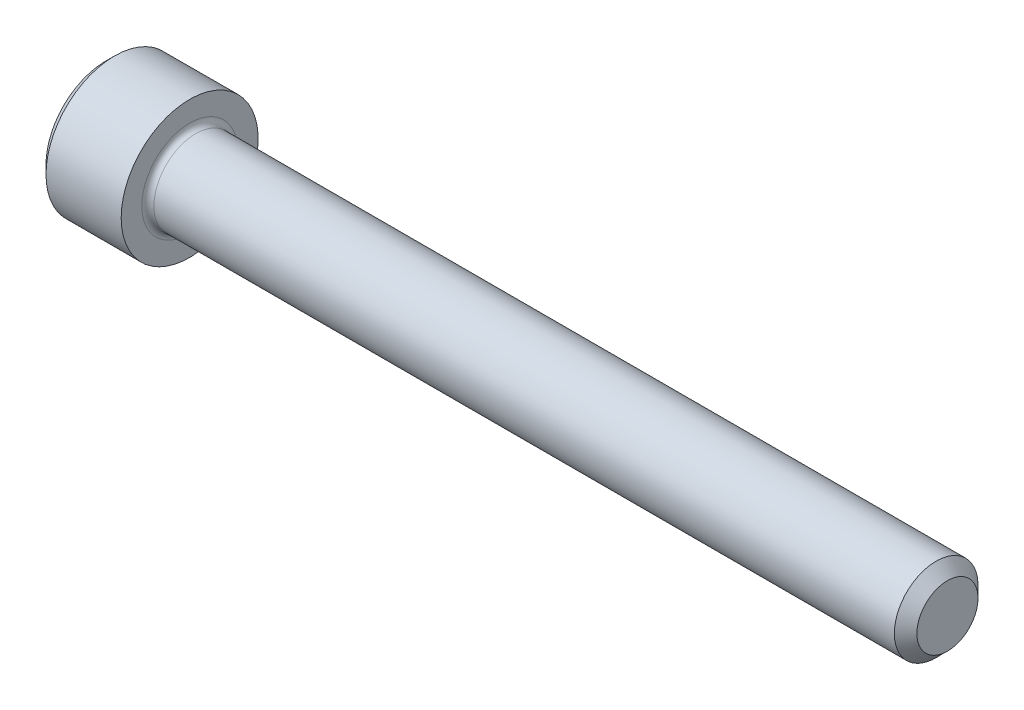
ISO-10303-21;
HEADER;
FILE_DESCRIPTION(('STEP AP214'),'2;1');
FILE_NAME('part.step','',(''),(''),'','','');
FILE_SCHEMA(('AUTOMOTIVE_DESIGN { 1 0 10303 214 1 1 1 1 }'));
ENDSEC;
DATA;
#1=APPLICATION_CONTEXT('core data for automotive mechanical design processes');
#2=APPLICATION_PROTOCOL_DEFINITION('international standard','automotive_design',2000,#1);
#3=PRODUCT_CONTEXT('',#1,'mechanical');
#4=PRODUCT('Part','Part','',(#3));
#5=PRODUCT_RELATED_PRODUCT_CATEGORY('part','',(#4));
#6=PRODUCT_DEFINITION_FORMATION('','',#4);
#7=PRODUCT_DEFINITION_CONTEXT('part definition',#1,'design');
#8=PRODUCT_DEFINITION('design','',#6,#7);
#9=PRODUCT_DEFINITION_SHAPE('','',#8);
#10=(LENGTH_UNIT() NAMED_UNIT(*) SI_UNIT(.MILLI.,.METRE.));
#11=(NAMED_UNIT(*) PLANE_ANGLE_UNIT() SI_UNIT($,.RADIAN.));
#12=(NAMED_UNIT(*) SI_UNIT($,.STERADIAN.) SOLID_ANGLE_UNIT());
#13=UNCERTAINTY_MEASURE_WITH_UNIT(LENGTH_MEASURE(1.E-05),#10,'distance_accuracy_value','');
#14=(GEOMETRIC_REPRESENTATION_CONTEXT(3) GLOBAL_UNCERTAINTY_ASSIGNED_CONTEXT((#13)) GLOBAL_UNIT_ASSIGNED_CONTEXT((#10,
#11,#12)) REPRESENTATION_CONTEXT('',''));
#15=CARTESIAN_POINT('',(0.,0.,0.));
#16=DIRECTION('',(0.,0.,1.));
#17=DIRECTION('',(1.,0.,0.));
#18=AXIS2_PLACEMENT_3D('',#15,#16,#17);
#19=CARTESIAN_POINT('',(1.62560000006806,0.,0.));
#20=DIRECTION('',(-1.,0.,0.));
#21=DIRECTION('',(0.,0.,1.));
#22=AXIS2_PLACEMENT_3D('',#19,#20,#21);
#23=CONICAL_SURFACE('',#22,1.38430000004064,1.04719755119643);
#24=CARTESIAN_POINT('',(2.42482597772664,0.,5.6843418860808E-11));
#25=VERTEX_POINT('',#24);
#26=VERTEX_LOOP('',#25);
#27=FACE_BOUND('',#26,.T.);
#28=CARTESIAN_POINT('',(1.62560000006806,0.,0.));
#29=DIRECTION('',(-1.,0.,0.));
#30=DIRECTION('',(0.,0.,1.));
#31=AXIS2_PLACEMENT_3D('',#28,#29,#30);
#32=CIRCLE('',#31,1.38430000004064);
#33=CARTESIAN_POINT('',(1.62560000003403,0.,1.38430000002032));
#34=VERTEX_POINT('',#33);
#35=CARTESIAN_POINT('',(1.62560000003403,-1.19883896647639,0.69215000001016));
#36=VERTEX_POINT('',#35);
#37=EDGE_CURVE('E98',#34,#36,#32,.F.);
#38=ORIENTED_EDGE('',*,*,#37,.F.);
#39=CARTESIAN_POINT('',(1.62560000006806,0.,0.));
#40=DIRECTION('',(-1.,0.,0.));
#41=DIRECTION('',(0.,0.,1.));
#42=AXIS2_PLACEMENT_3D('',#39,#40,#41);
#43=CIRCLE('',#42,1.38430000004064);
#44=CARTESIAN_POINT('',(1.62560000003403,1.1988389664764,0.692150000010158));
#45=VERTEX_POINT('',#44);
#46=EDGE_CURVE('E95',#45,#34,#43,.F.);
#47=ORIENTED_EDGE('',*,*,#46,.F.);
#48=CARTESIAN_POINT('',(1.62560000006806,0.,0.));
#49=DIRECTION('',(-1.,0.,0.));
#50=DIRECTION('',(0.,0.,1.));
#51=AXIS2_PLACEMENT_3D('',#48,#49,#50);
#52=CIRCLE('',#51,1.38430000004064);
#53=CARTESIAN_POINT('',(1.62560000003403,1.1988389664764,-0.692150000010162));
#54=VERTEX_POINT('',#53);
#55=EDGE_CURVE('E156',#54,#45,#52,.F.);
#56=ORIENTED_EDGE('',*,*,#55,.F.);
#57=CARTESIAN_POINT('',(1.62560000006806,0.,0.));
#58=DIRECTION('',(-1.,0.,0.));
#59=DIRECTION('',(0.,0.,1.));
#60=AXIS2_PLACEMENT_3D('',#57,#58,#59);
#61=CIRCLE('',#60,1.38430000004064);
#62=CARTESIAN_POINT('',(1.62560000003403,0.,-1.38430000002032));
#63=VERTEX_POINT('',#62);
#64=EDGE_CURVE('E153',#63,#54,#61,.F.);
#65=ORIENTED_EDGE('',*,*,#64,.F.);
#66=CARTESIAN_POINT('',(1.62560000006806,0.,0.));
#67=DIRECTION('',(-1.,0.,0.));
#68=DIRECTION('',(0.,0.,1.));
#69=AXIS2_PLACEMENT_3D('',#66,#67,#68);
#70=CIRCLE('',#69,1.38430000004064);
#71=CARTESIAN_POINT('',(1.62560000003403,-1.19883896647639,-0.692150000010157));
#72=VERTEX_POINT('',#71);
#73=EDGE_CURVE('E158',#72,#63,#70,.F.);
#74=ORIENTED_EDGE('',*,*,#73,.F.);
#75=CARTESIAN_POINT('',(1.62560000006806,0.,0.));
#76=DIRECTION('',(-1.,0.,0.));
#77=DIRECTION('',(0.,0.,1.));
#78=AXIS2_PLACEMENT_3D('',#75,#76,#77);
#79=CIRCLE('',#78,1.38430000004064);
#80=EDGE_CURVE('E101',#36,#72,#79,.F.);
#81=ORIENTED_EDGE('',*,*,#80,.F.);
#82=EDGE_LOOP('',(#38,#47,#56,#65,#74,#81));
#83=FACE_BOUND('',#82,.T.);
#84=ADVANCED_FACE('F16',(#27,#83),#23,.F.);
#85=CARTESIAN_POINT('',(1.6256,0.799225977639204,1.3843));
#86=DIRECTION('',(-1.,0.,0.));
#87=DIRECTION('',(0.,0.,1.));
#88=AXIS2_PLACEMENT_3D('',#85,#86,#87);
#89=PLANE('',#88);
#90=DIRECTION('',(0.,-1.,0.));
#91=VECTOR('',#90,1.);
#92=CARTESIAN_POINT('',(1.6256,-0.799225977639192,1.3843));
#93=LINE('',#92,#91);
#94=CARTESIAN_POINT('',(1.6256,0.799225977639205,1.3843));
#95=VERTEX_POINT('',#94);
#96=EDGE_CURVE('E113',#34,#95,#93,.F.);
#97=ORIENTED_EDGE('',*,*,#96,.T.);
#98=DIRECTION('',(0.,0.499999999999999,-0.86602540378444));
#99=VECTOR('',#98,1.);
#100=CARTESIAN_POINT('',(1.6256,1.5984519552784,0.));
#101=LINE('',#100,#99);
#102=EDGE_CURVE('E114',#45,#95,#101,.F.);
#103=ORIENTED_EDGE('',*,*,#102,.F.);
#104=ORIENTED_EDGE('',*,*,#46,.T.);
#105=EDGE_LOOP('',(#97,#103,#104));
#106=FACE_BOUND('',#105,.T.);
#107=ADVANCED_FACE('F118',(#106),#89,.T.);
#108=CARTESIAN_POINT('',(1.6256,0.799225977639204,1.3843));
#109=DIRECTION('',(-1.,0.,0.));
#110=DIRECTION('',(0.,0.,1.));
#111=AXIS2_PLACEMENT_3D('',#108,#109,#110);
#112=PLANE('',#111);
#113=DIRECTION('',(0.,0.500000000000001,0.866025403784438));
#114=VECTOR('',#113,1.);
#115=CARTESIAN_POINT('',(1.6256,-0.799225977639192,1.3843));
#116=LINE('',#115,#114);
#117=CARTESIAN_POINT('',(1.6256,-0.799225977639192,1.3843));
#118=VERTEX_POINT('',#117);
#119=EDGE_CURVE('E109',#118,#36,#116,.F.);
#120=ORIENTED_EDGE('',*,*,#119,.F.);
#121=DIRECTION('',(0.,-1.,0.));
#122=VECTOR('',#121,1.);
#123=CARTESIAN_POINT('',(1.6256,-0.799225977639192,1.3843));
#124=LINE('',#123,#122);
#125=EDGE_CURVE('E106',#118,#34,#124,.F.);
#126=ORIENTED_EDGE('',*,*,#125,.T.);
#127=ORIENTED_EDGE('',*,*,#37,.T.);
#128=EDGE_LOOP('',(#120,#126,#127));
#129=FACE_BOUND('',#128,.T.);
#130=ADVANCED_FACE('F107',(#129),#112,.T.);
#131=CARTESIAN_POINT('',(1.6256,0.799225977639204,1.3843));
#132=DIRECTION('',(-1.,0.,0.));
#133=DIRECTION('',(0.,0.,1.));
#134=AXIS2_PLACEMENT_3D('',#131,#132,#133);
#135=PLANE('',#134);
#136=DIRECTION('',(0.,-0.499999999999999,0.866025403784439));
#137=VECTOR('',#136,1.);
#138=CARTESIAN_POINT('',(1.6256,-1.59845195527839,0.));
#139=LINE('',#138,#137);
#140=CARTESIAN_POINT('',(1.6256,-1.59845195527839,0.));
#141=VERTEX_POINT('',#140);
#142=EDGE_CURVE('E420',#141,#72,#139,.F.);
#143=ORIENTED_EDGE('',*,*,#142,.F.);
#144=DIRECTION('',(0.,0.500000000000001,0.866025403784438));
#145=VECTOR('',#144,1.);
#146=CARTESIAN_POINT('',(1.6256,-0.799225977639192,1.3843));
#147=LINE('',#146,#145);
#148=EDGE_CURVE('E422',#36,#141,#147,.F.);
#149=ORIENTED_EDGE('',*,*,#148,.F.);
#150=ORIENTED_EDGE('',*,*,#80,.T.);
#151=EDGE_LOOP('',(#143,#149,#150));
#152=FACE_BOUND('',#151,.T.);
#153=ADVANCED_FACE('F277',(#152),#135,.T.);
#154=CARTESIAN_POINT('',(1.6256,0.799225977639204,1.3843));
#155=DIRECTION('',(-1.,0.,0.));
#156=DIRECTION('',(0.,0.,1.));
#157=AXIS2_PLACEMENT_3D('',#154,#155,#156);
#158=PLANE('',#157);
#159=DIRECTION('',(0.,1.,0.));
#160=VECTOR('',#159,1.);
#161=CARTESIAN_POINT('',(1.6256,0.799225977639201,-1.3843));
#162=LINE('',#161,#160);
#163=CARTESIAN_POINT('',(1.6256,-0.799225977639196,-1.3843));
#164=VERTEX_POINT('',#163);
#165=EDGE_CURVE('E476',#63,#164,#162,.F.);
#166=ORIENTED_EDGE('',*,*,#165,.T.);
#167=DIRECTION('',(0.,-0.499999999999999,0.866025403784439));
#168=VECTOR('',#167,1.);
#169=CARTESIAN_POINT('',(1.6256,-1.59845195527839,0.));
#170=LINE('',#169,#168);
#171=EDGE_CURVE('E425',#72,#164,#170,.F.);
#172=ORIENTED_EDGE('',*,*,#171,.F.);
#173=ORIENTED_EDGE('',*,*,#73,.T.);
#174=EDGE_LOOP('',(#166,#172,#173));
#175=FACE_BOUND('',#174,.T.);
#176=ADVANCED_FACE('F273',(#175),#158,.T.);
#177=CARTESIAN_POINT('',(1.6256,0.799225977639204,1.3843));
#178=DIRECTION('',(-1.,0.,0.));
#179=DIRECTION('',(0.,0.,1.));
#180=AXIS2_PLACEMENT_3D('',#177,#178,#179);
#181=PLANE('',#180);
#182=DIRECTION('',(0.,0.499999999999999,-0.86602540378444));
#183=VECTOR('',#182,1.);
#184=CARTESIAN_POINT('',(1.6256,1.5984519552784,0.));
#185=LINE('',#184,#183);
#186=CARTESIAN_POINT('',(1.6256,1.5984519552784,0.));
#187=VERTEX_POINT('',#186);
#188=EDGE_CURVE('E136',#187,#45,#185,.F.);
#189=ORIENTED_EDGE('',*,*,#188,.F.);
#190=DIRECTION('',(0.,0.500000000000001,0.866025403784438));
#191=VECTOR('',#190,1.);
#192=CARTESIAN_POINT('',(1.6256,1.5984519552784,0.));
#193=LINE('',#192,#191);
#194=EDGE_CURVE('E491',#187,#54,#193,.F.);
#195=ORIENTED_EDGE('',*,*,#194,.T.);
#196=ORIENTED_EDGE('',*,*,#55,.T.);
#197=EDGE_LOOP('',(#189,#195,#196));
#198=FACE_BOUND('',#197,.T.);
#199=ADVANCED_FACE('F269',(#198),#181,.T.);
#200=CARTESIAN_POINT('',(1.6256,0.799225977639204,1.3843));
#201=DIRECTION('',(-1.,0.,0.));
#202=DIRECTION('',(0.,0.,1.));
#203=AXIS2_PLACEMENT_3D('',#200,#201,#202);
#204=PLANE('',#203);
#205=DIRECTION('',(0.,0.500000000000001,0.866025403784438));
#206=VECTOR('',#205,1.);
#207=CARTESIAN_POINT('',(1.6256,1.5984519552784,0.));
#208=LINE('',#207,#206);
#209=CARTESIAN_POINT('',(1.6256,0.799225977639201,-1.3843));
#210=VERTEX_POINT('',#209);
#211=EDGE_CURVE('E465',#54,#210,#208,.F.);
#212=ORIENTED_EDGE('',*,*,#211,.T.);
#213=DIRECTION('',(0.,1.,0.));
#214=VECTOR('',#213,1.);
#215=CARTESIAN_POINT('',(1.6256,0.799225977639201,-1.3843));
#216=LINE('',#215,#214);
#217=EDGE_CURVE('E479',#210,#63,#216,.F.);
#218=ORIENTED_EDGE('',*,*,#217,.T.);
#219=ORIENTED_EDGE('',*,*,#64,.T.);
#220=EDGE_LOOP('',(#212,#218,#219));
#221=FACE_BOUND('',#220,.T.);
#222=ADVANCED_FACE('F265',(#221),#204,.T.);
#223=CARTESIAN_POINT('',(1.6256,1.5984519552784,0.));
#224=DIRECTION('',(0.,-0.86602540378444,-0.499999999999999));
#225=DIRECTION('',(0.,0.499999999999999,-0.86602540378444));
#226=AXIS2_PLACEMENT_3D('',#223,#224,#225);
#227=PLANE('',#226);
#228=ORIENTED_EDGE('',*,*,#102,.T.);
#229=DIRECTION('',(1.,0.,0.));
#230=VECTOR('',#229,1.);
#231=CARTESIAN_POINT('',(1.6256,0.799225977639205,1.3843));
#232=LINE('',#231,#230);
#233=CARTESIAN_POINT('',(0.,0.799225977639205,1.3843));
#234=VERTEX_POINT('',#233);
#235=EDGE_CURVE('E125',#95,#234,#232,.F.);
#236=ORIENTED_EDGE('',*,*,#235,.T.);
#237=DIRECTION('',(0.,-0.499999999999999,0.866025403784439));
#238=VECTOR('',#237,1.);
#239=CARTESIAN_POINT('',(0.,1.5984519552784,0.));
#240=LINE('',#239,#238);
#241=CARTESIAN_POINT('',(0.,1.5984519552784,0.));
#242=VERTEX_POINT('',#241);
#243=EDGE_CURVE('E459',#242,#234,#240,.T.);
#244=ORIENTED_EDGE('',*,*,#243,.F.);
#245=DIRECTION('',(1.,0.,0.));
#246=VECTOR('',#245,1.);
#247=CARTESIAN_POINT('',(1.6256,1.5984519552784,0.));
#248=LINE('',#247,#246);
#249=EDGE_CURVE('E486',#242,#187,#248,.T.);
#250=ORIENTED_EDGE('',*,*,#249,.T.);
#251=ORIENTED_EDGE('',*,*,#188,.T.);
#252=EDGE_LOOP('',(#228,#236,#244,#250,#251));
#253=FACE_BOUND('',#252,.T.);
#254=ADVANCED_FACE('F262',(#253),#227,.T.);
#255=CARTESIAN_POINT('',(1.6256,-0.799225977639192,1.3843));
#256=DIRECTION('',(0.,0.,1.));
#257=DIRECTION('',(0.,-1.,0.));
#258=AXIS2_PLACEMENT_3D('',#255,#256,#257);
#259=PLANE('',#258);
#260=ORIENTED_EDGE('',*,*,#235,.F.);
#261=ORIENTED_EDGE('',*,*,#96,.F.);
#262=ORIENTED_EDGE('',*,*,#125,.F.);
#263=DIRECTION('',(1.,0.,0.));
#264=VECTOR('',#263,1.);
#265=CARTESIAN_POINT('',(1.6256,-0.799225977639192,1.3843));
#266=LINE('',#265,#264);
#267=CARTESIAN_POINT('',(0.,-0.799225977639192,1.3843));
#268=VERTEX_POINT('',#267);
#269=EDGE_CURVE('E127',#268,#118,#266,.T.);
#270=ORIENTED_EDGE('',*,*,#269,.F.);
#271=DIRECTION('',(0.,1.,0.));
#272=VECTOR('',#271,1.);
#273=CARTESIAN_POINT('',(0.,0.,1.3843));
#274=LINE('',#273,#272);
#275=EDGE_CURVE('E448',#234,#268,#274,.F.);
#276=ORIENTED_EDGE('',*,*,#275,.F.);
#277=EDGE_LOOP('',(#260,#261,#262,#270,#276));
#278=FACE_BOUND('',#277,.T.);
#279=ADVANCED_FACE('F123',(#278),#259,.F.);
#280=CARTESIAN_POINT('',(1.6256,-0.799225977639192,1.3843));
#281=DIRECTION('',(0.,0.866025403784438,-0.500000000000001));
#282=DIRECTION('',(0.,0.500000000000001,0.866025403784438));
#283=AXIS2_PLACEMENT_3D('',#280,#281,#282);
#284=PLANE('',#283);
#285=ORIENTED_EDGE('',*,*,#148,.T.);
#286=DIRECTION('',(1.,0.,0.));
#287=VECTOR('',#286,1.);
#288=CARTESIAN_POINT('',(1.6256,-1.59845195527839,0.));
#289=LINE('',#288,#287);
#290=CARTESIAN_POINT('',(0.,-1.59845195527839,0.));
#291=VERTEX_POINT('',#290);
#292=EDGE_CURVE('E426',#291,#141,#289,.T.);
#293=ORIENTED_EDGE('',*,*,#292,.F.);
#294=DIRECTION('',(0.,-0.500000000000001,-0.866025403784438));
#295=VECTOR('',#294,1.);
#296=CARTESIAN_POINT('',(0.,-0.799225977639192,1.3843));
#297=LINE('',#296,#295);
#298=EDGE_CURVE('E444',#268,#291,#297,.T.);
#299=ORIENTED_EDGE('',*,*,#298,.F.);
#300=ORIENTED_EDGE('',*,*,#269,.T.);
#301=ORIENTED_EDGE('',*,*,#119,.T.);
#302=EDGE_LOOP('',(#285,#293,#299,#300,#301));
#303=FACE_BOUND('',#302,.T.);
#304=ADVANCED_FACE('F255',(#303),#284,.T.);
#305=CARTESIAN_POINT('',(1.6256,-1.59845195527839,0.));
#306=DIRECTION('',(0.,0.866025403784439,0.499999999999999));
#307=DIRECTION('',(0.,-0.499999999999999,0.866025403784439));
#308=AXIS2_PLACEMENT_3D('',#305,#306,#307);
#309=PLANE('',#308);
#310=ORIENTED_EDGE('',*,*,#171,.T.);
#311=DIRECTION('',(1.,0.,0.));
#312=VECTOR('',#311,1.);
#313=CARTESIAN_POINT('',(1.6256,-0.799225977639196,-1.3843));
#314=LINE('',#313,#312);
#315=CARTESIAN_POINT('',(0.,-0.799225977639196,-1.3843));
#316=VERTEX_POINT('',#315);
#317=EDGE_CURVE('E478',#164,#316,#314,.F.);
#318=ORIENTED_EDGE('',*,*,#317,.T.);
#319=DIRECTION('',(0.,0.499999999999999,-0.866025403784439));
#320=VECTOR('',#319,1.);
#321=CARTESIAN_POINT('',(0.,-1.59845195527839,0.));
#322=LINE('',#321,#320);
#323=EDGE_CURVE('E430',#291,#316,#322,.T.);
#324=ORIENTED_EDGE('',*,*,#323,.F.);
#325=ORIENTED_EDGE('',*,*,#292,.T.);
#326=ORIENTED_EDGE('',*,*,#142,.T.);
#327=EDGE_LOOP('',(#310,#318,#324,#325,#326));
#328=FACE_BOUND('',#327,.T.);
#329=ADVANCED_FACE('F251',(#328),#309,.T.);
#330=CARTESIAN_POINT('',(1.6256,0.799225977639201,-1.3843));
#331=DIRECTION('',(0.,0.,-1.));
#332=DIRECTION('',(0.,1.,0.));
#333=AXIS2_PLACEMENT_3D('',#330,#331,#332);
#334=PLANE('',#333);
#335=ORIENTED_EDGE('',*,*,#317,.F.);
#336=ORIENTED_EDGE('',*,*,#165,.F.);
#337=ORIENTED_EDGE('',*,*,#217,.F.);
#338=DIRECTION('',(1.,0.,0.));
#339=VECTOR('',#338,1.);
#340=CARTESIAN_POINT('',(1.6256,0.799225977639201,-1.3843));
#341=LINE('',#340,#339);
#342=CARTESIAN_POINT('',(0.,0.799225977639201,-1.3843));
#343=VERTEX_POINT('',#342);
#344=EDGE_CURVE('E462',#210,#343,#341,.F.);
#345=ORIENTED_EDGE('',*,*,#344,.T.);
#346=DIRECTION('',(0.,1.,0.));
#347=VECTOR('',#346,1.);
#348=CARTESIAN_POINT('',(0.,0.,-1.3843));
#349=LINE('',#348,#347);
#350=EDGE_CURVE('E443',#316,#343,#349,.T.);
#351=ORIENTED_EDGE('',*,*,#350,.F.);
#352=EDGE_LOOP('',(#335,#336,#337,#345,#351));
#353=FACE_BOUND('',#352,.T.);
#354=ADVANCED_FACE('F247',(#353),#334,.F.);
#355=CARTESIAN_POINT('',(1.6256,1.5984519552784,0.));
#356=DIRECTION('',(0.,0.866025403784438,-0.500000000000001));
#357=DIRECTION('',(0.,0.500000000000001,0.866025403784438));
#358=AXIS2_PLACEMENT_3D('',#355,#356,#357);
#359=PLANE('',#358);
#360=ORIENTED_EDGE('',*,*,#344,.F.);
#361=ORIENTED_EDGE('',*,*,#211,.F.);
#362=ORIENTED_EDGE('',*,*,#194,.F.);
#363=ORIENTED_EDGE('',*,*,#249,.F.);
#364=DIRECTION('',(0.,0.500000000000001,0.866025403784438));
#365=VECTOR('',#364,1.);
#366=CARTESIAN_POINT('',(0.,0.799225977639201,-1.3843));
#367=LINE('',#366,#365);
#368=EDGE_CURVE('E152',#343,#242,#367,.T.);
#369=ORIENTED_EDGE('',*,*,#368,.F.);
#370=EDGE_LOOP('',(#360,#361,#362,#363,#369));
#371=FACE_BOUND('',#370,.T.);
#372=ADVANCED_FACE('F243',(#371),#359,.F.);
#373=CARTESIAN_POINT('',(0.,0.,0.));
#374=DIRECTION('',(-1.,0.,0.));
#375=DIRECTION('',(0.,0.,1.));
#376=AXIS2_PLACEMENT_3D('',#373,#374,#375);
#377=PLANE('',#376);
#378=CARTESIAN_POINT('',(0.,0.,0.));
#379=DIRECTION('',(1.,0.,0.));
#380=DIRECTION('',(0.,0.,-1.));
#381=AXIS2_PLACEMENT_3D('',#378,#379,#380);
#382=CIRCLE('',#381,2.5145999999836);
#383=CARTESIAN_POINT('',(0.,0.,-2.5145999999836));
#384=VERTEX_POINT('',#383);
#385=EDGE_CURVE('E149',#384,#384,#382,.T.);
#386=ORIENTED_EDGE('',*,*,#385,.F.);
#387=EDGE_LOOP('',(#386));
#388=FACE_BOUND('',#387,.T.);
#389=ORIENTED_EDGE('',*,*,#350,.T.);
#390=ORIENTED_EDGE('',*,*,#368,.T.);
#391=ORIENTED_EDGE('',*,*,#243,.T.);
#392=ORIENTED_EDGE('',*,*,#275,.T.);
#393=ORIENTED_EDGE('',*,*,#298,.T.);
#394=ORIENTED_EDGE('',*,*,#323,.T.);
#395=EDGE_LOOP('',(#389,#390,#391,#392,#393,#394));
#396=FACE_BOUND('',#395,.T.);
#397=ADVANCED_FACE('F235',(#388,#396),#377,.T.);
#398=CARTESIAN_POINT('',(0.355599999863898,0.,0.));
#399=DIRECTION('',(1.,0.,0.));
#400=DIRECTION('',(0.,0.,-1.));
#401=AXIS2_PLACEMENT_3D('',#398,#399,#400);
#402=CONICAL_SURFACE('',#401,2.87019999990434,0.785398163477374);
#403=ORIENTED_EDGE('',*,*,#385,.T.);
#404=EDGE_LOOP('',(#403));
#405=FACE_BOUND('',#404,.T.);
#406=CARTESIAN_POINT('',(0.355599999999998,0.,0.));
#407=DIRECTION('',(-1.,0.,0.));
#408=DIRECTION('',(0.,0.,1.));
#409=AXIS2_PLACEMENT_3D('',#406,#407,#408);
#410=CIRCLE('',#409,2.8702);
#411=CARTESIAN_POINT('',(0.355599999999998,0.,2.8702));
#412=VERTEX_POINT('',#411);
#413=EDGE_CURVE('E148',#412,#412,#410,.F.);
#414=ORIENTED_EDGE('',*,*,#413,.F.);
#415=EDGE_LOOP('',(#414));
#416=FACE_BOUND('',#415,.T.);
#417=ADVANCED_FACE('F230',(#405,#416),#402,.T.);
#418=CARTESIAN_POINT('',(-31.75,0.,0.));
#419=DIRECTION('',(-1.,0.,0.));
#420=DIRECTION('',(0.,0.,1.));
#421=AXIS2_PLACEMENT_3D('',#418,#419,#420);
#422=CYLINDRICAL_SURFACE('',#421,2.8702);
#423=CARTESIAN_POINT('',(3.5052,0.,0.));
#424=DIRECTION('',(-1.,0.,0.));
#425=DIRECTION('',(0.,0.,1.));
#426=AXIS2_PLACEMENT_3D('',#423,#424,#425);
#427=CIRCLE('',#426,2.8702);
#428=CARTESIAN_POINT('',(3.5052,0.,2.8702));
#429=VERTEX_POINT('',#428);
#430=EDGE_CURVE('E145',#429,#429,#427,.F.);
#431=ORIENTED_EDGE('',*,*,#430,.F.);
#432=EDGE_LOOP('',(#431));
#433=FACE_BOUND('',#432,.T.);
#434=ORIENTED_EDGE('',*,*,#413,.T.);
#435=EDGE_LOOP('',(#434));
#436=FACE_BOUND('',#435,.T.);
#437=ADVANCED_FACE('F226',(#433,#436),#422,.T.);
#438=CARTESIAN_POINT('',(35.2552,1.28016,0.));
#439=DIRECTION('',(1.,0.,0.));
#440=DIRECTION('',(0.,0.,-1.));
#441=AXIS2_PLACEMENT_3D('',#438,#439,#440);
#442=PLANE('',#441);
#443=CARTESIAN_POINT('',(35.2551999999946,0.,0.));
#444=DIRECTION('',(-1.,0.,0.));
#445=DIRECTION('',(0.,0.,1.));
#446=AXIS2_PLACEMENT_3D('',#443,#444,#445);
#447=CIRCLE('',#446,1.28016000007847);
#448=CARTESIAN_POINT('',(35.2551999999946,0.,1.28016000007847));
#449=VERTEX_POINT('',#448);
#450=EDGE_CURVE('E141',#449,#449,#447,.T.);
#451=ORIENTED_EDGE('',*,*,#450,.F.);
#452=EDGE_LOOP('',(#451));
#453=FACE_BOUND('',#452,.T.);
#454=ADVANCED_FACE('F184',(#453),#442,.T.);
#455=CARTESIAN_POINT('',(3.5052,2.8702,0.));
#456=DIRECTION('',(1.,0.,0.));
#457=DIRECTION('',(0.,0.,-1.));
#458=AXIS2_PLACEMENT_3D('',#455,#456,#457);
#459=PLANE('',#458);
#460=ORIENTED_EDGE('',*,*,#430,.T.);
#461=EDGE_LOOP('',(#460));
#462=FACE_BOUND('',#461,.T.);
#463=CARTESIAN_POINT('',(3.5052,0.,0.));
#464=DIRECTION('',(1.,0.,0.));
#465=DIRECTION('',(0.,0.,1.));
#466=AXIS2_PLACEMENT_3D('',#463,#464,#465);
#467=CIRCLE('',#466,2.0066);
#468=CARTESIAN_POINT('',(3.5052,0.,-2.0066));
#469=VERTEX_POINT('',#468);
#470=CARTESIAN_POINT('',(3.5052,0.,2.0066));
#471=VERTEX_POINT('',#470);
#472=EDGE_CURVE('E144',#469,#471,#467,.F.);
#473=ORIENTED_EDGE('',*,*,#472,.T.);
#474=CARTESIAN_POINT('',(3.5052,0.,0.));
#475=DIRECTION('',(1.,0.,0.));
#476=DIRECTION('',(0.,0.,-1.));
#477=AXIS2_PLACEMENT_3D('',#474,#475,#476);
#478=CIRCLE('',#477,2.0066);
#479=EDGE_CURVE('E35',#471,#469,#478,.F.);
#480=ORIENTED_EDGE('',*,*,#479,.T.);
#481=EDGE_LOOP('',(#473,#480));
#482=FACE_BOUND('',#481,.T.);
#483=ADVANCED_FACE('F165',(#462,#482),#459,.T.);
#484=CARTESIAN_POINT('',(34.7827599999846,0.,0.));
#485=DIRECTION('',(-1.,0.,0.));
#486=DIRECTION('',(0.,0.,1.));
#487=AXIS2_PLACEMENT_3D('',#484,#485,#486);
#488=CONICAL_SURFACE('',#487,1.75260000008848,0.785398163397448);
#489=CARTESIAN_POINT('',(34.78276,0.,0.));
#490=DIRECTION('',(-1.,0.,0.));
#491=DIRECTION('',(0.,0.,1.));
#492=AXIS2_PLACEMENT_3D('',#489,#490,#491);
#493=CIRCLE('',#492,1.7526);
#494=CARTESIAN_POINT('',(34.78276,0.,1.7526));
#495=VERTEX_POINT('',#494);
#496=EDGE_CURVE('E27',#495,#495,#493,.T.);
#497=ORIENTED_EDGE('',*,*,#496,.F.);
#498=EDGE_LOOP('',(#497));
#499=FACE_BOUND('',#498,.T.);
#500=ORIENTED_EDGE('',*,*,#450,.T.);
#501=EDGE_LOOP('',(#500));
#502=FACE_BOUND('',#501,.T.);
#503=ADVANCED_FACE('F183',(#499,#502),#488,.T.);
#504=CARTESIAN_POINT('',(3.7592,0.,0.));
#505=DIRECTION('',(1.,0.,0.));
#506=DIRECTION('',(0.,0.,-1.));
#507=AXIS2_PLACEMENT_3D('',#504,#505,#506);
#508=TOROIDAL_SURFACE('',#507,2.0066,0.254);
#509=CARTESIAN_POINT('',(3.7592,0.,0.));
#510=DIRECTION('',(-1.,0.,0.));
#511=DIRECTION('',(0.,0.,1.));
#512=AXIS2_PLACEMENT_3D('',#509,#510,#511);
#513=CIRCLE('',#512,1.7526);
#514=CARTESIAN_POINT('',(3.7592,0.,1.7526));
#515=VERTEX_POINT('',#514);
#516=EDGE_CURVE('E11',#515,#515,#513,.F.);
#517=ORIENTED_EDGE('',*,*,#516,.F.);
#518=EDGE_LOOP('',(#517));
#519=FACE_BOUND('',#518,.T.);
#520=ORIENTED_EDGE('',*,*,#472,.F.);
#521=ORIENTED_EDGE('',*,*,#479,.F.);
#522=EDGE_LOOP('',(#520,#521));
#523=FACE_BOUND('',#522,.T.);
#524=ADVANCED_FACE('F162',(#519,#523),#508,.F.);
#525=CARTESIAN_POINT('',(-31.75,0.,0.));
#526=DIRECTION('',(-1.,0.,0.));
#527=DIRECTION('',(0.,0.,1.));
#528=AXIS2_PLACEMENT_3D('',#525,#526,#527);
#529=CYLINDRICAL_SURFACE('',#528,1.7526);
#530=ORIENTED_EDGE('',*,*,#516,.T.);
#531=EDGE_LOOP('',(#530));
#532=FACE_BOUND('',#531,.T.);
#533=ORIENTED_EDGE('',*,*,#496,.T.);
#534=EDGE_LOOP('',(#533));
#535=FACE_BOUND('',#534,.T.);
#536=ADVANCED_FACE('F208',(#532,#535),#529,.T.);
#537=CLOSED_SHELL('',(#84,#107,#130,#153,#176,#199,#222,#254,#279,#304,#329,#354,#372,#397,#417,
#437,#454,#483,#503,#524,#536));
#538=MANIFOLD_SOLID_BREP('B1',#537);
#539=ADVANCED_BREP_SHAPE_REPRESENTATION('',(#18,#538),#14);
#540=SHAPE_DEFINITION_REPRESENTATION(#9,#539);
ENDSEC;
END-ISO-10303-21;
